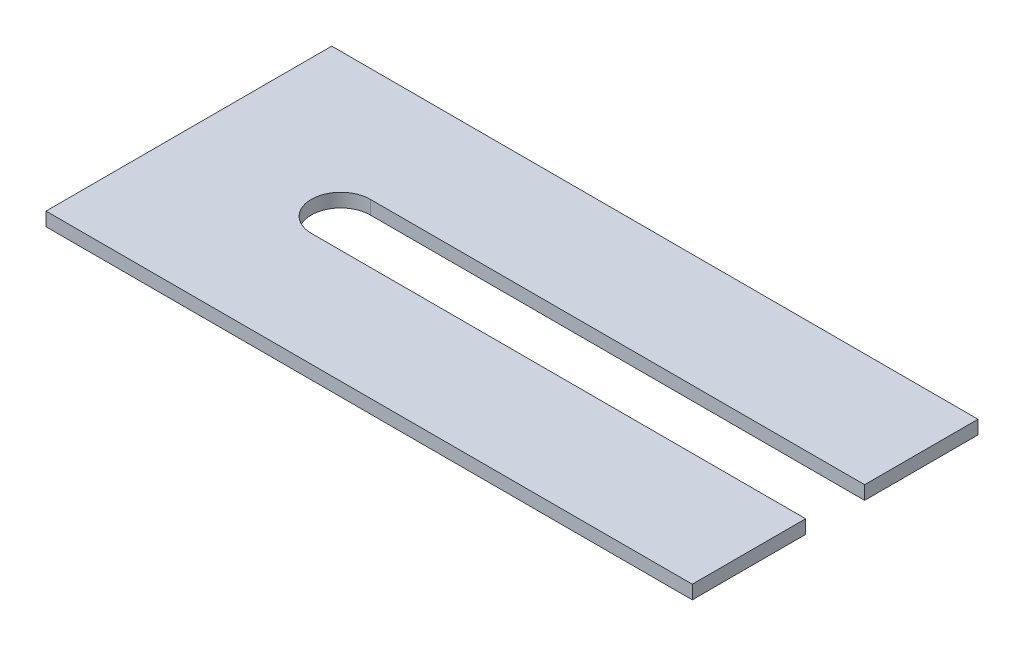
ISO-10303-21;
HEADER;
FILE_DESCRIPTION(('STEP AP214'),'2;1');
FILE_NAME('part.step','',(''),(''),'','','');
FILE_SCHEMA(('AUTOMOTIVE_DESIGN { 1 0 10303 214 1 1 1 1 }'));
ENDSEC;
DATA;
#1=APPLICATION_CONTEXT('core data for automotive mechanical design processes');
#2=APPLICATION_PROTOCOL_DEFINITION('international standard','automotive_design',2000,#1);
#3=PRODUCT_CONTEXT('',#1,'mechanical');
#4=PRODUCT('Part','Part','',(#3));
#5=PRODUCT_RELATED_PRODUCT_CATEGORY('part','',(#4));
#6=PRODUCT_DEFINITION_FORMATION('','',#4);
#7=PRODUCT_DEFINITION_CONTEXT('part definition',#1,'design');
#8=PRODUCT_DEFINITION('design','',#6,#7);
#9=PRODUCT_DEFINITION_SHAPE('','',#8);
#10=(LENGTH_UNIT() NAMED_UNIT(*) SI_UNIT(.MILLI.,.METRE.));
#11=(NAMED_UNIT(*) PLANE_ANGLE_UNIT() SI_UNIT($,.RADIAN.));
#12=(NAMED_UNIT(*) SI_UNIT($,.STERADIAN.) SOLID_ANGLE_UNIT());
#13=UNCERTAINTY_MEASURE_WITH_UNIT(LENGTH_MEASURE(1.E-05),#10,'distance_accuracy_value','');
#14=(GEOMETRIC_REPRESENTATION_CONTEXT(3) GLOBAL_UNCERTAINTY_ASSIGNED_CONTEXT((#13)) GLOBAL_UNIT_ASSIGNED_CONTEXT((#10,
#11,#12)) REPRESENTATION_CONTEXT('',''));
#15=CARTESIAN_POINT('',(0.,0.,0.));
#16=DIRECTION('',(0.,0.,1.));
#17=DIRECTION('',(1.,0.,0.));
#18=AXIS2_PLACEMENT_3D('',#15,#16,#17);
#19=CARTESIAN_POINT('',(16.75,1.5,-15.75));
#20=DIRECTION('',(0.,-1.,0.));
#21=DIRECTION('',(0.,0.,-1.));
#22=AXIS2_PLACEMENT_3D('',#19,#20,#21);
#23=CYLINDRICAL_SURFACE('',#22,3.25);
#24=CARTESIAN_POINT('',(16.75,0.,-15.75));
#25=DIRECTION('',(0.,1.,0.));
#26=DIRECTION('',(0.,0.,1.));
#27=AXIS2_PLACEMENT_3D('',#24,#25,#26);
#28=CIRCLE('',#27,3.25);
#29=CARTESIAN_POINT('',(16.75,0.,-19.));
#30=VERTEX_POINT('',#29);
#31=CARTESIAN_POINT('',(16.75,0.,-12.5));
#32=VERTEX_POINT('',#31);
#33=EDGE_CURVE('E191',#30,#32,#28,.T.);
#34=ORIENTED_EDGE('',*,*,#33,.F.);
#35=DIRECTION('',(0.,-1.,0.));
#36=VECTOR('',#35,1.);
#37=CARTESIAN_POINT('',(16.75,1.5,-19.));
#38=LINE('',#37,#36);
#39=CARTESIAN_POINT('',(16.75,1.5,-19.));
#40=VERTEX_POINT('',#39);
#41=EDGE_CURVE('E11',#40,#30,#38,.T.);
#42=ORIENTED_EDGE('',*,*,#41,.F.);
#43=CARTESIAN_POINT('',(16.75,1.5,-15.75));
#44=DIRECTION('',(0.,1.,0.));
#45=DIRECTION('',(0.,0.,1.));
#46=AXIS2_PLACEMENT_3D('',#43,#44,#45);
#47=CIRCLE('',#46,3.25);
#48=CARTESIAN_POINT('',(16.75,1.5,-12.5));
#49=VERTEX_POINT('',#48);
#50=EDGE_CURVE('E147',#40,#49,#47,.T.);
#51=ORIENTED_EDGE('',*,*,#50,.T.);
#52=DIRECTION('',(0.,-1.,0.));
#53=VECTOR('',#52,1.);
#54=CARTESIAN_POINT('',(16.75,1.5,-12.5));
#55=LINE('',#54,#53);
#56=EDGE_CURVE('E91',#49,#32,#55,.T.);
#57=ORIENTED_EDGE('',*,*,#56,.T.);
#58=EDGE_LOOP('',(#34,#42,#51,#57));
#59=FACE_BOUND('',#58,.T.);
#60=ADVANCED_FACE('F39',(#59),#23,.F.);
#61=CARTESIAN_POINT('',(0.,1.5,-19.));
#62=DIRECTION('',(0.,0.,1.));
#63=DIRECTION('',(1.,0.,0.));
#64=AXIS2_PLACEMENT_3D('',#61,#62,#63);
#65=PLANE('',#64);
#66=DIRECTION('',(-1.,0.,0.));
#67=VECTOR('',#66,1.);
#68=CARTESIAN_POINT('',(0.,0.,-19.));
#69=LINE('',#68,#67);
#70=CARTESIAN_POINT('',(71.25,0.,-19.));
#71=VERTEX_POINT('',#70);
#72=EDGE_CURVE('E184',#71,#30,#69,.T.);
#73=ORIENTED_EDGE('',*,*,#72,.F.);
#74=DIRECTION('',(0.,-1.,0.));
#75=VECTOR('',#74,1.);
#76=CARTESIAN_POINT('',(71.25,1.5,-19.));
#77=LINE('',#76,#75);
#78=CARTESIAN_POINT('',(71.25,1.5,-19.));
#79=VERTEX_POINT('',#78);
#80=EDGE_CURVE('E48',#79,#71,#77,.T.);
#81=ORIENTED_EDGE('',*,*,#80,.F.);
#82=DIRECTION('',(-1.,0.,0.));
#83=VECTOR('',#82,1.);
#84=CARTESIAN_POINT('',(0.,1.5,-19.));
#85=LINE('',#84,#83);
#86=EDGE_CURVE('E139',#79,#40,#85,.T.);
#87=ORIENTED_EDGE('',*,*,#86,.T.);
#88=ORIENTED_EDGE('',*,*,#41,.T.);
#89=EDGE_LOOP('',(#73,#81,#87,#88));
#90=FACE_BOUND('',#89,.T.);
#91=ADVANCED_FACE('F189',(#90),#65,.T.);
#92=CARTESIAN_POINT('',(71.25,1.5,0.));
#93=DIRECTION('',(-1.,0.,0.));
#94=DIRECTION('',(0.,0.,1.));
#95=AXIS2_PLACEMENT_3D('',#92,#93,#94);
#96=PLANE('',#95);
#97=DIRECTION('',(0.,0.,-1.));
#98=VECTOR('',#97,1.);
#99=CARTESIAN_POINT('',(71.25,0.,0.));
#100=LINE('',#99,#98);
#101=CARTESIAN_POINT('',(71.25,0.,-31.5));
#102=VERTEX_POINT('',#101);
#103=EDGE_CURVE('E159',#71,#102,#100,.T.);
#104=ORIENTED_EDGE('',*,*,#103,.T.);
#105=DIRECTION('',(0.,-1.,0.));
#106=VECTOR('',#105,1.);
#107=CARTESIAN_POINT('',(71.25,1.5,-31.5));
#108=LINE('',#107,#106);
#109=CARTESIAN_POINT('',(71.25,1.5,-31.5));
#110=VERTEX_POINT('',#109);
#111=EDGE_CURVE('E172',#110,#102,#108,.T.);
#112=ORIENTED_EDGE('',*,*,#111,.F.);
#113=DIRECTION('',(0.,0.,-1.));
#114=VECTOR('',#113,1.);
#115=CARTESIAN_POINT('',(71.25,1.5,0.));
#116=LINE('',#115,#114);
#117=EDGE_CURVE('E132',#79,#110,#116,.T.);
#118=ORIENTED_EDGE('',*,*,#117,.F.);
#119=ORIENTED_EDGE('',*,*,#80,.T.);
#120=EDGE_LOOP('',(#104,#112,#118,#119));
#121=FACE_BOUND('',#120,.T.);
#122=ADVANCED_FACE('F178',(#121),#96,.F.);
#123=CARTESIAN_POINT('',(0.,1.5,-31.5));
#124=DIRECTION('',(0.,0.,-1.));
#125=DIRECTION('',(-1.,0.,0.));
#126=AXIS2_PLACEMENT_3D('',#123,#124,#125);
#127=PLANE('',#126);
#128=DIRECTION('',(1.,0.,0.));
#129=VECTOR('',#128,1.);
#130=CARTESIAN_POINT('',(0.,0.,-31.5));
#131=LINE('',#130,#129);
#132=CARTESIAN_POINT('',(0.,0.,-31.5));
#133=VERTEX_POINT('',#132);
#134=EDGE_CURVE('E187',#133,#102,#131,.T.);
#135=ORIENTED_EDGE('',*,*,#134,.F.);
#136=DIRECTION('',(0.,-1.,0.));
#137=VECTOR('',#136,1.);
#138=CARTESIAN_POINT('',(0.,1.5,-31.5));
#139=LINE('',#138,#137);
#140=CARTESIAN_POINT('',(0.,1.5,-31.5));
#141=VERTEX_POINT('',#140);
#142=EDGE_CURVE('E169',#141,#133,#139,.T.);
#143=ORIENTED_EDGE('',*,*,#142,.F.);
#144=DIRECTION('',(1.,0.,0.));
#145=VECTOR('',#144,1.);
#146=CARTESIAN_POINT('',(0.,1.5,-31.5));
#147=LINE('',#146,#145);
#148=EDGE_CURVE('E138',#141,#110,#147,.T.);
#149=ORIENTED_EDGE('',*,*,#148,.T.);
#150=ORIENTED_EDGE('',*,*,#111,.T.);
#151=EDGE_LOOP('',(#135,#143,#149,#150));
#152=FACE_BOUND('',#151,.T.);
#153=ADVANCED_FACE('F204',(#152),#127,.T.);
#154=CARTESIAN_POINT('',(0.,1.5,0.));
#155=DIRECTION('',(-1.,0.,0.));
#156=DIRECTION('',(0.,0.,1.));
#157=AXIS2_PLACEMENT_3D('',#154,#155,#156);
#158=PLANE('',#157);
#159=DIRECTION('',(0.,0.,-1.));
#160=VECTOR('',#159,1.);
#161=CARTESIAN_POINT('',(0.,0.,0.));
#162=LINE('',#161,#160);
#163=CARTESIAN_POINT('',(0.,0.,0.));
#164=VERTEX_POINT('',#163);
#165=EDGE_CURVE('E197',#164,#133,#162,.T.);
#166=ORIENTED_EDGE('',*,*,#165,.F.);
#167=DIRECTION('',(0.,-1.,0.));
#168=VECTOR('',#167,1.);
#169=CARTESIAN_POINT('',(0.,1.5,0.));
#170=LINE('',#169,#168);
#171=CARTESIAN_POINT('',(0.,1.5,0.));
#172=VERTEX_POINT('',#171);
#173=EDGE_CURVE('E126',#172,#164,#170,.T.);
#174=ORIENTED_EDGE('',*,*,#173,.F.);
#175=DIRECTION('',(0.,0.,-1.));
#176=VECTOR('',#175,1.);
#177=CARTESIAN_POINT('',(0.,1.5,0.));
#178=LINE('',#177,#176);
#179=EDGE_CURVE('E117',#172,#141,#178,.T.);
#180=ORIENTED_EDGE('',*,*,#179,.T.);
#181=ORIENTED_EDGE('',*,*,#142,.T.);
#182=EDGE_LOOP('',(#166,#174,#180,#181));
#183=FACE_BOUND('',#182,.T.);
#184=ADVANCED_FACE('F202',(#183),#158,.T.);
#185=CARTESIAN_POINT('',(0.,1.5,0.));
#186=DIRECTION('',(0.,0.,-1.));
#187=DIRECTION('',(-1.,0.,0.));
#188=AXIS2_PLACEMENT_3D('',#185,#186,#187);
#189=PLANE('',#188);
#190=DIRECTION('',(1.,0.,0.));
#191=VECTOR('',#190,1.);
#192=CARTESIAN_POINT('',(0.,0.,0.));
#193=LINE('',#192,#191);
#194=CARTESIAN_POINT('',(71.25,0.,0.));
#195=VERTEX_POINT('',#194);
#196=EDGE_CURVE('E124',#164,#195,#193,.T.);
#197=ORIENTED_EDGE('',*,*,#196,.T.);
#198=DIRECTION('',(0.,-1.,0.));
#199=VECTOR('',#198,1.);
#200=CARTESIAN_POINT('',(71.25,1.5,0.));
#201=LINE('',#200,#199);
#202=CARTESIAN_POINT('',(71.25,1.5,0.));
#203=VERTEX_POINT('',#202);
#204=EDGE_CURVE('E121',#203,#195,#201,.T.);
#205=ORIENTED_EDGE('',*,*,#204,.F.);
#206=DIRECTION('',(1.,0.,0.));
#207=VECTOR('',#206,1.);
#208=CARTESIAN_POINT('',(0.,1.5,0.));
#209=LINE('',#208,#207);
#210=EDGE_CURVE('E110',#172,#203,#209,.T.);
#211=ORIENTED_EDGE('',*,*,#210,.F.);
#212=ORIENTED_EDGE('',*,*,#173,.T.);
#213=EDGE_LOOP('',(#197,#205,#211,#212));
#214=FACE_BOUND('',#213,.T.);
#215=ADVANCED_FACE('F122',(#214),#189,.F.);
#216=CARTESIAN_POINT('',(71.25,0.,-12.5));
#217=VERTEX_POINT('',#216);
#218=EDGE_CURVE('E84',#195,#217,#100,.T.);
#219=ORIENTED_EDGE('',*,*,#218,.T.);
#220=DIRECTION('',(0.,-1.,0.));
#221=VECTOR('',#220,1.);
#222=CARTESIAN_POINT('',(71.25,1.5,-12.5));
#223=LINE('',#222,#221);
#224=CARTESIAN_POINT('',(71.25,1.5,-12.5));
#225=VERTEX_POINT('',#224);
#226=EDGE_CURVE('E127',#225,#217,#223,.T.);
#227=ORIENTED_EDGE('',*,*,#226,.F.);
#228=EDGE_CURVE('E114',#203,#225,#116,.T.);
#229=ORIENTED_EDGE('',*,*,#228,.F.);
#230=ORIENTED_EDGE('',*,*,#204,.T.);
#231=EDGE_LOOP('',(#219,#227,#229,#230));
#232=FACE_BOUND('',#231,.T.);
#233=ADVANCED_FACE('F129',(#232),#96,.F.);
#234=CARTESIAN_POINT('',(0.,1.5,-12.5));
#235=DIRECTION('',(0.,0.,1.));
#236=DIRECTION('',(1.,0.,0.));
#237=AXIS2_PLACEMENT_3D('',#234,#235,#236);
#238=PLANE('',#237);
#239=DIRECTION('',(-1.,0.,0.));
#240=VECTOR('',#239,1.);
#241=CARTESIAN_POINT('',(0.,0.,-12.5));
#242=LINE('',#241,#240);
#243=EDGE_CURVE('E150',#217,#32,#242,.T.);
#244=ORIENTED_EDGE('',*,*,#243,.T.);
#245=ORIENTED_EDGE('',*,*,#56,.F.);
#246=DIRECTION('',(-1.,0.,0.));
#247=VECTOR('',#246,1.);
#248=CARTESIAN_POINT('',(0.,1.5,-12.5));
#249=LINE('',#248,#247);
#250=EDGE_CURVE('E56',#225,#49,#249,.T.);
#251=ORIENTED_EDGE('',*,*,#250,.F.);
#252=ORIENTED_EDGE('',*,*,#226,.T.);
#253=EDGE_LOOP('',(#244,#245,#251,#252));
#254=FACE_BOUND('',#253,.T.);
#255=ADVANCED_FACE('F250',(#254),#238,.F.);
#256=CARTESIAN_POINT('',(0.,1.5,0.));
#257=DIRECTION('',(0.,1.,0.));
#258=DIRECTION('',(0.,0.,1.));
#259=AXIS2_PLACEMENT_3D('',#256,#257,#258);
#260=PLANE('',#259);
#261=ORIENTED_EDGE('',*,*,#50,.F.);
#262=ORIENTED_EDGE('',*,*,#86,.F.);
#263=ORIENTED_EDGE('',*,*,#117,.T.);
#264=ORIENTED_EDGE('',*,*,#148,.F.);
#265=ORIENTED_EDGE('',*,*,#179,.F.);
#266=ORIENTED_EDGE('',*,*,#210,.T.);
#267=ORIENTED_EDGE('',*,*,#228,.T.);
#268=ORIENTED_EDGE('',*,*,#250,.T.);
#269=EDGE_LOOP('',(#261,#262,#263,#264,#265,#266,#267,#268));
#270=FACE_BOUND('',#269,.T.);
#271=ADVANCED_FACE('F112',(#270),#260,.T.);
#272=CARTESIAN_POINT('',(0.,0.,0.));
#273=DIRECTION('',(0.,1.,0.));
#274=DIRECTION('',(0.,0.,1.));
#275=AXIS2_PLACEMENT_3D('',#272,#273,#274);
#276=PLANE('',#275);
#277=ORIENTED_EDGE('',*,*,#33,.T.);
#278=ORIENTED_EDGE('',*,*,#243,.F.);
#279=ORIENTED_EDGE('',*,*,#218,.F.);
#280=ORIENTED_EDGE('',*,*,#196,.F.);
#281=ORIENTED_EDGE('',*,*,#165,.T.);
#282=ORIENTED_EDGE('',*,*,#134,.T.);
#283=ORIENTED_EDGE('',*,*,#103,.F.);
#284=ORIENTED_EDGE('',*,*,#72,.T.);
#285=EDGE_LOOP('',(#277,#278,#279,#280,#281,#282,#283,#284));
#286=FACE_BOUND('',#285,.T.);
#287=ADVANCED_FACE('F183',(#286),#276,.F.);
#288=CLOSED_SHELL('',(#60,#91,#122,#153,#184,#215,#233,#255,#271,#287));
#289=MANIFOLD_SOLID_BREP('B2',#288);
#290=ADVANCED_BREP_SHAPE_REPRESENTATION('',(#18,#289),#14);
#291=SHAPE_DEFINITION_REPRESENTATION(#9,#290);
ENDSEC;
END-ISO-10303-21;
